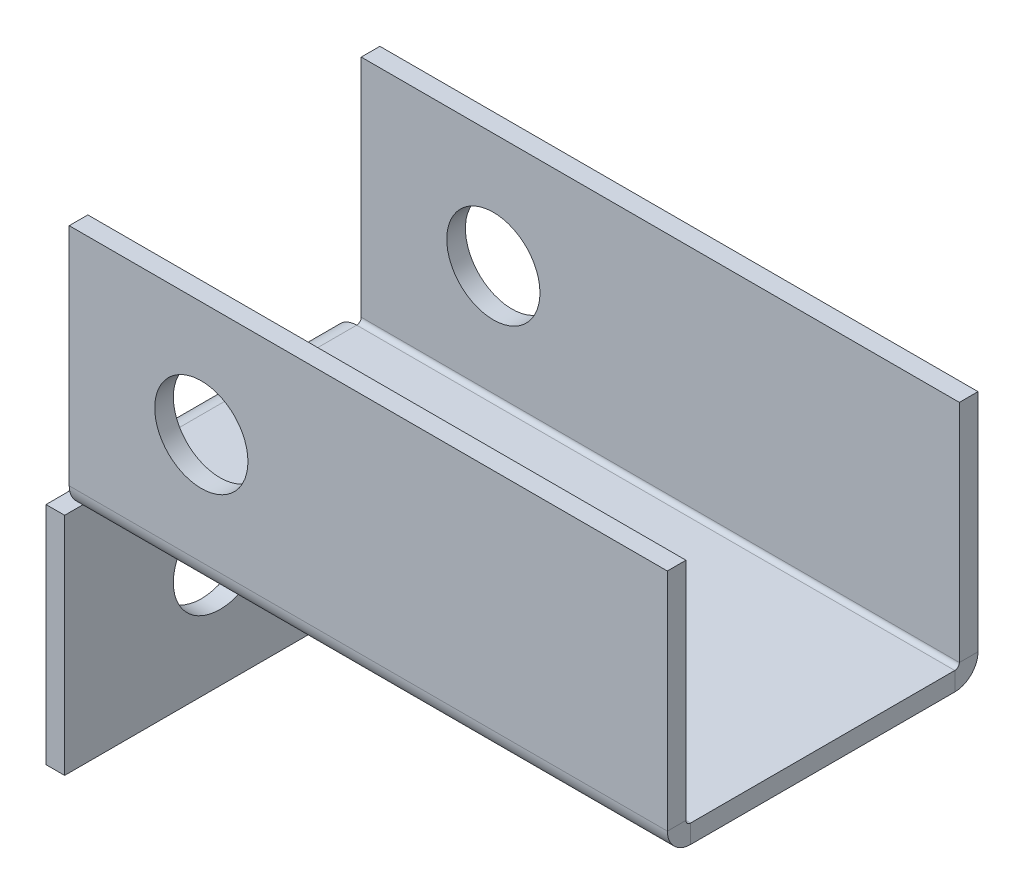
ISO-10303-21;
HEADER;
FILE_DESCRIPTION(('STEP AP214'),'2;1');
FILE_NAME('part.step','',(''),(''),'','','');
FILE_SCHEMA(('AUTOMOTIVE_DESIGN { 1 0 10303 214 1 1 1 1 }'));
ENDSEC;
DATA;
#1=APPLICATION_CONTEXT('core data for automotive mechanical design processes');
#2=APPLICATION_PROTOCOL_DEFINITION('international standard','automotive_design',2000,#1);
#3=PRODUCT_CONTEXT('',#1,'mechanical');
#4=PRODUCT('Part','Part','',(#3));
#5=PRODUCT_RELATED_PRODUCT_CATEGORY('part','',(#4));
#6=PRODUCT_DEFINITION_FORMATION('','',#4);
#7=PRODUCT_DEFINITION_CONTEXT('part definition',#1,'design');
#8=PRODUCT_DEFINITION('design','',#6,#7);
#9=PRODUCT_DEFINITION_SHAPE('','',#8);
#10=(LENGTH_UNIT() NAMED_UNIT(*) SI_UNIT(.MILLI.,.METRE.));
#11=(NAMED_UNIT(*) PLANE_ANGLE_UNIT() SI_UNIT($,.RADIAN.));
#12=(NAMED_UNIT(*) SI_UNIT($,.STERADIAN.) SOLID_ANGLE_UNIT());
#13=UNCERTAINTY_MEASURE_WITH_UNIT(LENGTH_MEASURE(1.E-05),#10,'distance_accuracy_value','');
#14=(GEOMETRIC_REPRESENTATION_CONTEXT(3) GLOBAL_UNCERTAINTY_ASSIGNED_CONTEXT((#13)) GLOBAL_UNIT_ASSIGNED_CONTEXT((#10,
#11,#12)) REPRESENTATION_CONTEXT('',''));
#15=CARTESIAN_POINT('',(0.,0.,0.));
#16=DIRECTION('',(0.,0.,1.));
#17=DIRECTION('',(1.,0.,0.));
#18=AXIS2_PLACEMENT_3D('',#15,#16,#17);
#19=CARTESIAN_POINT('',(0.,-3.73660000000017,0.));
#20=DIRECTION('',(0.,-1.,0.));
#21=DIRECTION('',(1.,0.,0.));
#22=AXIS2_PLACEMENT_3D('',#19,#20,#21);
#23=PLANE('',#22);
#24=DIRECTION('',(-1.,0.,0.));
#25=VECTOR('',#24,1.);
#26=CARTESIAN_POINT('',(-47.,-3.7366,-21.2634));
#27=LINE('',#26,#25);
#28=CARTESIAN_POINT('',(-47.,-3.7366,-21.2634));
#29=VERTEX_POINT('',#28);
#30=CARTESIAN_POINT('',(-50.,-3.73659999999999,-21.2634));
#31=VERTEX_POINT('',#30);
#32=EDGE_CURVE('E13',#29,#31,#27,.T.);
#33=ORIENTED_EDGE('',*,*,#32,.F.);
#34=DIRECTION('',(0.,0.,-1.));
#35=VECTOR('',#34,1.);
#36=CARTESIAN_POINT('',(-47.,-3.7366,25.));
#37=LINE('',#36,#35);
#38=CARTESIAN_POINT('',(-47.,-3.7366,-25.));
#39=VERTEX_POINT('',#38);
#40=EDGE_CURVE('E375',#29,#39,#37,.T.);
#41=ORIENTED_EDGE('',*,*,#40,.T.);
#42=DIRECTION('',(1.,0.,0.));
#43=VECTOR('',#42,1.);
#44=CARTESIAN_POINT('',(-47.,-3.7366,-25.));
#45=LINE('',#44,#43);
#46=CARTESIAN_POINT('',(-50.,-3.73659999999999,-25.));
#47=VERTEX_POINT('',#46);
#48=EDGE_CURVE('E369',#39,#47,#45,.F.);
#49=ORIENTED_EDGE('',*,*,#48,.T.);
#50=DIRECTION('',(0.,0.,-1.));
#51=VECTOR('',#50,1.);
#52=CARTESIAN_POINT('',(-50.,-3.73659999999999,25.));
#53=LINE('',#52,#51);
#54=EDGE_CURVE('E365',#47,#31,#53,.F.);
#55=ORIENTED_EDGE('',*,*,#54,.T.);
#56=EDGE_LOOP('',(#33,#41,#49,#55));
#57=FACE_BOUND('',#56,.T.);
#58=ADVANCED_FACE('F103',(#57),#23,.F.);
#59=CARTESIAN_POINT('',(-46.2634,-3.7366,-25.));
#60=DIRECTION('',(0.,0.,-1.));
#61=DIRECTION('',(-1.,0.,0.));
#62=AXIS2_PLACEMENT_3D('',#59,#60,#61);
#63=CYLINDRICAL_SURFACE('',#62,3.73659999999999);
#64=DIRECTION('',(0.,0.,-1.));
#65=VECTOR('',#64,1.);
#66=CARTESIAN_POINT('',(-46.2634,0.,-25.));
#67=LINE('',#66,#65);
#68=CARTESIAN_POINT('',(-46.2634,0.,-21.2634));
#69=VERTEX_POINT('',#68);
#70=CARTESIAN_POINT('',(-46.2634,0.,21.2634));
#71=VERTEX_POINT('',#70);
#72=EDGE_CURVE('E378',#69,#71,#67,.F.);
#73=ORIENTED_EDGE('',*,*,#72,.F.);
#74=CARTESIAN_POINT('',(-46.2634,-3.7366,-21.2634));
#75=DIRECTION('',(0.,0.,-1.));
#76=DIRECTION('',(0.,1.,0.));
#77=AXIS2_PLACEMENT_3D('',#74,#75,#76);
#78=CIRCLE('',#77,3.73659999999999);
#79=EDGE_CURVE('E111',#69,#31,#78,.F.);
#80=ORIENTED_EDGE('',*,*,#79,.T.);
#81=CARTESIAN_POINT('',(-50.,-3.73659999999999,21.2634));
#82=VERTEX_POINT('',#81);
#83=EDGE_CURVE('E367',#31,#82,#53,.F.);
#84=ORIENTED_EDGE('',*,*,#83,.T.);
#85=CARTESIAN_POINT('',(-46.2634,-3.7366,21.2634));
#86=DIRECTION('',(0.,0.,1.));
#87=DIRECTION('',(0.,-1.,0.));
#88=AXIS2_PLACEMENT_3D('',#85,#86,#87);
#89=CIRCLE('',#88,3.73659999999999);
#90=EDGE_CURVE('E387',#82,#71,#89,.F.);
#91=ORIENTED_EDGE('',*,*,#90,.T.);
#92=EDGE_LOOP('',(#73,#80,#84,#91));
#93=FACE_BOUND('',#92,.T.);
#94=ADVANCED_FACE('F402',(#93),#63,.T.);
#95=CARTESIAN_POINT('',(-46.2634,-3.7366,-21.2634));
#96=DIRECTION('',(0.,0.,-1.));
#97=DIRECTION('',(0.,1.,0.));
#98=AXIS2_PLACEMENT_3D('',#95,#96,#97);
#99=PLANE('',#98);
#100=CARTESIAN_POINT('',(-46.2634,-3.7366,-21.2634));
#101=DIRECTION('',(0.,0.,-1.));
#102=DIRECTION('',(0.,1.,0.));
#103=AXIS2_PLACEMENT_3D('',#100,#101,#102);
#104=CIRCLE('',#103,0.73659999999999);
#105=CARTESIAN_POINT('',(-46.2634,-3.00000000000002,-21.2634));
#106=VERTEX_POINT('',#105);
#107=EDGE_CURVE('E397',#106,#29,#104,.F.);
#108=ORIENTED_EDGE('',*,*,#107,.T.);
#109=ORIENTED_EDGE('',*,*,#32,.T.);
#110=ORIENTED_EDGE('',*,*,#79,.F.);
#111=DIRECTION('',(0.,-1.,0.));
#112=VECTOR('',#111,1.);
#113=CARTESIAN_POINT('',(-46.2634,0.,-21.2634));
#114=LINE('',#113,#112);
#115=EDGE_CURVE('E274',#69,#106,#114,.T.);
#116=ORIENTED_EDGE('',*,*,#115,.T.);
#117=EDGE_LOOP('',(#108,#109,#110,#116));
#118=FACE_BOUND('',#117,.T.);
#119=ADVANCED_FACE('F496',(#118),#99,.T.);
#120=CARTESIAN_POINT('',(0.,-3.,0.));
#121=DIRECTION('',(0.,-1.,0.));
#122=DIRECTION('',(0.,0.,-1.));
#123=AXIS2_PLACEMENT_3D('',#120,#121,#122);
#124=PLANE('',#123);
#125=DIRECTION('',(0.,0.,-1.));
#126=VECTOR('',#125,1.);
#127=CARTESIAN_POINT('',(-46.2634,-3.00000000000001,-25.));
#128=LINE('',#127,#126);
#129=CARTESIAN_POINT('',(-46.2634,-3.00000000000001,21.2634));
#130=VERTEX_POINT('',#129);
#131=EDGE_CURVE('E347',#106,#130,#128,.F.);
#132=ORIENTED_EDGE('',*,*,#131,.F.);
#133=DIRECTION('',(-1.,0.,0.));
#134=VECTOR('',#133,1.);
#135=CARTESIAN_POINT('',(-46.2634,-3.00000000000002,-21.2634));
#136=LINE('',#135,#134);
#137=CARTESIAN_POINT('',(50.,-3.,-21.2634));
#138=VERTEX_POINT('',#137);
#139=EDGE_CURVE('E267',#106,#138,#136,.F.);
#140=ORIENTED_EDGE('',*,*,#139,.T.);
#141=DIRECTION('',(0.,0.,-1.));
#142=VECTOR('',#141,1.);
#143=CARTESIAN_POINT('',(50.,-3.,-25.));
#144=LINE('',#143,#142);
#145=CARTESIAN_POINT('',(50.,-3.,21.2634));
#146=VERTEX_POINT('',#145);
#147=EDGE_CURVE('E384',#146,#138,#144,.T.);
#148=ORIENTED_EDGE('',*,*,#147,.F.);
#149=DIRECTION('',(1.,0.,0.));
#150=VECTOR('',#149,1.);
#151=CARTESIAN_POINT('',(50.,-3.,21.2634));
#152=LINE('',#151,#150);
#153=EDGE_CURVE('E321',#146,#130,#152,.F.);
#154=ORIENTED_EDGE('',*,*,#153,.T.);
#155=EDGE_LOOP('',(#132,#140,#148,#154));
#156=FACE_BOUND('',#155,.T.);
#157=ADVANCED_FACE('F443',(#156),#124,.T.);
#158=CARTESIAN_POINT('',(0.,0.,0.));
#159=DIRECTION('',(0.,-1.,0.));
#160=DIRECTION('',(0.,0.,-1.));
#161=AXIS2_PLACEMENT_3D('',#158,#159,#160);
#162=PLANE('',#161);
#163=DIRECTION('',(-1.,0.,0.));
#164=VECTOR('',#163,1.);
#165=CARTESIAN_POINT('',(-46.2634,0.,-21.2634));
#166=LINE('',#165,#164);
#167=CARTESIAN_POINT('',(50.,0.,-21.2634));
#168=VERTEX_POINT('',#167);
#169=EDGE_CURVE('E280',#69,#168,#166,.F.);
#170=ORIENTED_EDGE('',*,*,#169,.F.);
#171=ORIENTED_EDGE('',*,*,#72,.T.);
#172=DIRECTION('',(1.,0.,0.));
#173=VECTOR('',#172,1.);
#174=CARTESIAN_POINT('',(50.,0.,21.2634));
#175=LINE('',#174,#173);
#176=CARTESIAN_POINT('',(50.,0.,21.2634));
#177=VERTEX_POINT('',#176);
#178=EDGE_CURVE('E334',#177,#71,#175,.F.);
#179=ORIENTED_EDGE('',*,*,#178,.F.);
#180=DIRECTION('',(0.,0.,-1.));
#181=VECTOR('',#180,1.);
#182=CARTESIAN_POINT('',(50.,0.,-25.));
#183=LINE('',#182,#181);
#184=EDGE_CURVE('E381',#177,#168,#183,.T.);
#185=ORIENTED_EDGE('',*,*,#184,.T.);
#186=EDGE_LOOP('',(#170,#171,#179,#185));
#187=FACE_BOUND('',#186,.T.);
#188=ADVANCED_FACE('F457',(#187),#162,.F.);
#189=CARTESIAN_POINT('',(0.,-3.73660000000017,0.));
#190=DIRECTION('',(0.,1.,0.));
#191=DIRECTION('',(-1.,0.,0.));
#192=AXIS2_PLACEMENT_3D('',#189,#190,#191);
#193=PLANE('',#192);
#194=DIRECTION('',(1.,0.,0.));
#195=VECTOR('',#194,1.);
#196=CARTESIAN_POINT('',(-50.,-3.73659999999999,21.2634));
#197=LINE('',#196,#195);
#198=CARTESIAN_POINT('',(-47.,-3.7366,21.2634));
#199=VERTEX_POINT('',#198);
#200=EDGE_CURVE('E395',#82,#199,#197,.T.);
#201=ORIENTED_EDGE('',*,*,#200,.F.);
#202=CARTESIAN_POINT('',(-50.,-3.73659999999999,25.));
#203=VERTEX_POINT('',#202);
#204=EDGE_CURVE('E368',#82,#203,#53,.F.);
#205=ORIENTED_EDGE('',*,*,#204,.T.);
#206=DIRECTION('',(1.,0.,0.));
#207=VECTOR('',#206,1.);
#208=CARTESIAN_POINT('',(-50.,-3.73659999999999,25.));
#209=LINE('',#208,#207);
#210=CARTESIAN_POINT('',(-47.,-3.7366,25.));
#211=VERTEX_POINT('',#210);
#212=EDGE_CURVE('E341',#211,#203,#209,.F.);
#213=ORIENTED_EDGE('',*,*,#212,.F.);
#214=EDGE_CURVE('E371',#211,#199,#37,.T.);
#215=ORIENTED_EDGE('',*,*,#214,.T.);
#216=EDGE_LOOP('',(#201,#205,#213,#215));
#217=FACE_BOUND('',#216,.T.);
#218=ADVANCED_FACE('F431',(#217),#193,.T.);
#219=CARTESIAN_POINT('',(50.,-3.,-25.));
#220=DIRECTION('',(1.,0.,0.));
#221=DIRECTION('',(0.,0.,-1.));
#222=AXIS2_PLACEMENT_3D('',#219,#220,#221);
#223=PLANE('',#222);
#224=DIRECTION('',(0.,-1.,0.));
#225=VECTOR('',#224,1.);
#226=CARTESIAN_POINT('',(50.,0.,-21.2634));
#227=LINE('',#226,#225);
#228=EDGE_CURVE('E285',#168,#138,#227,.T.);
#229=ORIENTED_EDGE('',*,*,#228,.F.);
#230=ORIENTED_EDGE('',*,*,#184,.F.);
#231=DIRECTION('',(0.,-1.,0.));
#232=VECTOR('',#231,1.);
#233=CARTESIAN_POINT('',(50.,0.,21.2634));
#234=LINE('',#233,#232);
#235=EDGE_CURVE('E328',#177,#146,#234,.T.);
#236=ORIENTED_EDGE('',*,*,#235,.T.);
#237=ORIENTED_EDGE('',*,*,#147,.T.);
#238=EDGE_LOOP('',(#229,#230,#236,#237));
#239=FACE_BOUND('',#238,.T.);
#240=ADVANCED_FACE('F454',(#239),#223,.T.);
#241=CARTESIAN_POINT('',(-46.2634,-3.7366,21.2634));
#242=DIRECTION('',(0.,0.,1.));
#243=DIRECTION('',(0.,-1.,0.));
#244=AXIS2_PLACEMENT_3D('',#241,#242,#243);
#245=PLANE('',#244);
#246=ORIENTED_EDGE('',*,*,#90,.F.);
#247=ORIENTED_EDGE('',*,*,#200,.T.);
#248=CARTESIAN_POINT('',(-46.2634,-3.7366,21.2634));
#249=DIRECTION('',(0.,0.,1.));
#250=DIRECTION('',(0.,-1.,0.));
#251=AXIS2_PLACEMENT_3D('',#248,#249,#250);
#252=CIRCLE('',#251,0.73659999999999);
#253=EDGE_CURVE('E392',#199,#130,#252,.F.);
#254=ORIENTED_EDGE('',*,*,#253,.T.);
#255=DIRECTION('',(0.,-1.,0.));
#256=VECTOR('',#255,1.);
#257=CARTESIAN_POINT('',(-46.2634,0.,21.2634));
#258=LINE('',#257,#256);
#259=EDGE_CURVE('E338',#71,#130,#258,.T.);
#260=ORIENTED_EDGE('',*,*,#259,.F.);
#261=EDGE_LOOP('',(#246,#247,#254,#260));
#262=FACE_BOUND('',#261,.T.);
#263=ADVANCED_FACE('F440',(#262),#245,.T.);
#264=CARTESIAN_POINT('',(-46.2634,-3.7366,-25.));
#265=DIRECTION('',(0.,0.,-1.));
#266=DIRECTION('',(-1.,0.,0.));
#267=AXIS2_PLACEMENT_3D('',#264,#265,#266);
#268=CYLINDRICAL_SURFACE('',#267,0.73659999999999);
#269=ORIENTED_EDGE('',*,*,#107,.F.);
#270=ORIENTED_EDGE('',*,*,#131,.T.);
#271=ORIENTED_EDGE('',*,*,#253,.F.);
#272=EDGE_CURVE('E374',#199,#29,#37,.T.);
#273=ORIENTED_EDGE('',*,*,#272,.T.);
#274=EDGE_LOOP('',(#269,#270,#271,#273));
#275=FACE_BOUND('',#274,.T.);
#276=ADVANCED_FACE('F435',(#275),#268,.F.);
#277=CARTESIAN_POINT('',(-50.0000000000001,-40.,-25.));
#278=DIRECTION('',(0.,0.,1.));
#279=DIRECTION('',(1.,0.,0.));
#280=AXIS2_PLACEMENT_3D('',#277,#278,#279);
#281=PLANE('',#280);
#282=ORIENTED_EDGE('',*,*,#48,.F.);
#283=DIRECTION('',(0.,1.,0.));
#284=VECTOR('',#283,1.);
#285=CARTESIAN_POINT('',(-47.0000000000001,-40.,-25.));
#286=LINE('',#285,#284);
#287=CARTESIAN_POINT('',(-47.0000000000001,-40.,-25.));
#288=VERTEX_POINT('',#287);
#289=EDGE_CURVE('E363',#39,#288,#286,.F.);
#290=ORIENTED_EDGE('',*,*,#289,.T.);
#291=DIRECTION('',(1.,0.,0.));
#292=VECTOR('',#291,1.);
#293=CARTESIAN_POINT('',(-50.0000000000001,-40.,-25.));
#294=LINE('',#293,#292);
#295=CARTESIAN_POINT('',(-50.0000000000001,-40.,-25.));
#296=VERTEX_POINT('',#295);
#297=EDGE_CURVE('E344',#296,#288,#294,.T.);
#298=ORIENTED_EDGE('',*,*,#297,.F.);
#299=DIRECTION('',(0.,-1.,0.));
#300=VECTOR('',#299,1.);
#301=CARTESIAN_POINT('',(-50.,1.90979454354656E-13,-25.));
#302=LINE('',#301,#300);
#303=EDGE_CURVE('E356',#47,#296,#302,.T.);
#304=ORIENTED_EDGE('',*,*,#303,.F.);
#305=EDGE_LOOP('',(#282,#290,#298,#304));
#306=FACE_BOUND('',#305,.T.);
#307=ADVANCED_FACE('F414',(#306),#281,.F.);
#308=CARTESIAN_POINT('',(-50.,-2.99999999999999,25.));
#309=DIRECTION('',(0.,0.,-1.));
#310=DIRECTION('',(-1.,0.,0.));
#311=AXIS2_PLACEMENT_3D('',#308,#309,#310);
#312=PLANE('',#311);
#313=ORIENTED_EDGE('',*,*,#212,.T.);
#314=DIRECTION('',(0.,1.,0.));
#315=VECTOR('',#314,1.);
#316=CARTESIAN_POINT('',(-50.,1.86291012527692E-13,25.));
#317=LINE('',#316,#315);
#318=CARTESIAN_POINT('',(-50.0000000000001,-40.,25.));
#319=VERTEX_POINT('',#318);
#320=EDGE_CURVE('E351',#319,#203,#317,.T.);
#321=ORIENTED_EDGE('',*,*,#320,.F.);
#322=DIRECTION('',(1.,0.,0.));
#323=VECTOR('',#322,1.);
#324=CARTESIAN_POINT('',(-50.0000000000001,-40.,25.));
#325=LINE('',#324,#323);
#326=CARTESIAN_POINT('',(-47.0000000000001,-40.,25.));
#327=VERTEX_POINT('',#326);
#328=EDGE_CURVE('E348',#319,#327,#325,.T.);
#329=ORIENTED_EDGE('',*,*,#328,.T.);
#330=DIRECTION('',(0.,-1.,0.));
#331=VECTOR('',#330,1.);
#332=CARTESIAN_POINT('',(-47.,-3.,25.));
#333=LINE('',#332,#331);
#334=EDGE_CURVE('E358',#327,#211,#333,.F.);
#335=ORIENTED_EDGE('',*,*,#334,.T.);
#336=EDGE_LOOP('',(#313,#321,#329,#335));
#337=FACE_BOUND('',#336,.T.);
#338=ADVANCED_FACE('F429',(#337),#312,.F.);
#339=CARTESIAN_POINT('',(-50.,1.88635233441174E-13,0.));
#340=DIRECTION('',(1.,0.,0.));
#341=DIRECTION('',(0.,1.,0.));
#342=AXIS2_PLACEMENT_3D('',#339,#340,#341);
#343=PLANE('',#342);
#344=CARTESIAN_POINT('',(-50.,-21.8683,0.));
#345=DIRECTION('',(-1.,0.,0.));
#346=DIRECTION('',(0.,-1.,0.));
#347=AXIS2_PLACEMENT_3D('',#344,#345,#346);
#348=CIRCLE('',#347,7.5);
#349=CARTESIAN_POINT('',(-50.0000000000001,-29.3683,0.));
#350=VERTEX_POINT('',#349);
#351=EDGE_CURVE('E859',#350,#350,#348,.T.);
#352=ORIENTED_EDGE('',*,*,#351,.F.);
#353=EDGE_LOOP('',(#352));
#354=FACE_BOUND('',#353,.T.);
#355=ORIENTED_EDGE('',*,*,#54,.F.);
#356=ORIENTED_EDGE('',*,*,#303,.T.);
#357=DIRECTION('',(0.,0.,1.));
#358=VECTOR('',#357,1.);
#359=CARTESIAN_POINT('',(-50.0000000000001,-40.,0.));
#360=LINE('',#359,#358);
#361=EDGE_CURVE('E354',#296,#319,#360,.T.);
#362=ORIENTED_EDGE('',*,*,#361,.T.);
#363=ORIENTED_EDGE('',*,*,#320,.T.);
#364=ORIENTED_EDGE('',*,*,#204,.F.);
#365=ORIENTED_EDGE('',*,*,#83,.F.);
#366=EDGE_LOOP('',(#355,#356,#362,#363,#364,#365));
#367=FACE_BOUND('',#366,.T.);
#368=ADVANCED_FACE('F408',(#354,#367),#343,.F.);
#369=CARTESIAN_POINT('',(-47.,1.78160789424645E-13,0.));
#370=DIRECTION('',(1.,0.,0.));
#371=DIRECTION('',(0.,1.,0.));
#372=AXIS2_PLACEMENT_3D('',#369,#370,#371);
#373=PLANE('',#372);
#374=CARTESIAN_POINT('',(-47.,-21.8683,0.));
#375=DIRECTION('',(1.,0.,0.));
#376=DIRECTION('',(0.,1.,0.));
#377=AXIS2_PLACEMENT_3D('',#374,#375,#376);
#378=CIRCLE('',#377,7.5);
#379=CARTESIAN_POINT('',(-47.,-14.3683,0.));
#380=VERTEX_POINT('',#379);
#381=EDGE_CURVE('E856',#380,#380,#378,.F.);
#382=ORIENTED_EDGE('',*,*,#381,.T.);
#383=EDGE_LOOP('',(#382));
#384=FACE_BOUND('',#383,.T.);
#385=ORIENTED_EDGE('',*,*,#289,.F.);
#386=ORIENTED_EDGE('',*,*,#40,.F.);
#387=ORIENTED_EDGE('',*,*,#272,.F.);
#388=ORIENTED_EDGE('',*,*,#214,.F.);
#389=ORIENTED_EDGE('',*,*,#334,.F.);
#390=DIRECTION('',(0.,0.,-1.));
#391=VECTOR('',#390,1.);
#392=CARTESIAN_POINT('',(-47.0000000000001,-40.,25.));
#393=LINE('',#392,#391);
#394=EDGE_CURVE('E361',#288,#327,#393,.F.);
#395=ORIENTED_EDGE('',*,*,#394,.F.);
#396=EDGE_LOOP('',(#385,#386,#387,#388,#389,#395));
#397=FACE_BOUND('',#396,.T.);
#398=ADVANCED_FACE('F418',(#384,#397),#373,.T.);
#399=CARTESIAN_POINT('',(-50.0000000000001,-40.,25.));
#400=DIRECTION('',(0.,1.,0.));
#401=DIRECTION('',(-1.,0.,0.));
#402=AXIS2_PLACEMENT_3D('',#399,#400,#401);
#403=PLANE('',#402);
#404=ORIENTED_EDGE('',*,*,#394,.T.);
#405=ORIENTED_EDGE('',*,*,#328,.F.);
#406=ORIENTED_EDGE('',*,*,#361,.F.);
#407=ORIENTED_EDGE('',*,*,#297,.T.);
#408=EDGE_LOOP('',(#404,#405,#406,#407));
#409=FACE_BOUND('',#408,.T.);
#410=ADVANCED_FACE('F426',(#409),#403,.F.);
#411=CARTESIAN_POINT('',(-46.2634,0.736599999999997,21.2634));
#412=DIRECTION('',(-1.,0.,0.));
#413=DIRECTION('',(0.,0.,1.));
#414=AXIS2_PLACEMENT_3D('',#411,#412,#413);
#415=PLANE('',#414);
#416=DIRECTION('',(0.,0.,-1.));
#417=VECTOR('',#416,1.);
#418=CARTESIAN_POINT('',(-46.2634,0.736599999999997,25.));
#419=LINE('',#418,#417);
#420=CARTESIAN_POINT('',(-46.2634,0.736599999999997,22.));
#421=VERTEX_POINT('',#420);
#422=CARTESIAN_POINT('',(-46.2634,0.736599999999997,25.));
#423=VERTEX_POINT('',#422);
#424=EDGE_CURVE('E288',#421,#423,#419,.F.);
#425=ORIENTED_EDGE('',*,*,#424,.F.);
#426=CARTESIAN_POINT('',(-46.2634,0.736599999999997,21.2634));
#427=DIRECTION('',(1.,0.,0.));
#428=DIRECTION('',(0.,0.,-1.));
#429=AXIS2_PLACEMENT_3D('',#426,#427,#428);
#430=CIRCLE('',#429,0.7366);
#431=EDGE_CURVE('E331',#71,#421,#430,.F.);
#432=ORIENTED_EDGE('',*,*,#431,.F.);
#433=ORIENTED_EDGE('',*,*,#259,.T.);
#434=CARTESIAN_POINT('',(-46.2634,0.736599999999997,21.2634));
#435=DIRECTION('',(1.,0.,0.));
#436=DIRECTION('',(0.,0.,-1.));
#437=AXIS2_PLACEMENT_3D('',#434,#435,#436);
#438=CIRCLE('',#437,3.7366);
#439=EDGE_CURVE('E324',#130,#423,#438,.F.);
#440=ORIENTED_EDGE('',*,*,#439,.T.);
#441=EDGE_LOOP('',(#425,#432,#433,#440));
#442=FACE_BOUND('',#441,.T.);
#443=ADVANCED_FACE('F463',(#442),#415,.T.);
#444=CARTESIAN_POINT('',(50.,0.736599999999997,21.2634));
#445=DIRECTION('',(-1.,0.,0.));
#446=DIRECTION('',(0.,0.,1.));
#447=AXIS2_PLACEMENT_3D('',#444,#445,#446);
#448=PLANE('',#447);
#449=CARTESIAN_POINT('',(50.,0.736599999999997,21.2634));
#450=DIRECTION('',(1.,0.,0.));
#451=DIRECTION('',(0.,0.,-1.));
#452=AXIS2_PLACEMENT_3D('',#449,#450,#451);
#453=CIRCLE('',#452,0.7366);
#454=CARTESIAN_POINT('',(50.,0.736599999999997,22.));
#455=VERTEX_POINT('',#454);
#456=EDGE_CURVE('E294',#455,#177,#453,.T.);
#457=ORIENTED_EDGE('',*,*,#456,.F.);
#458=DIRECTION('',(0.,0.,-1.));
#459=VECTOR('',#458,1.);
#460=CARTESIAN_POINT('',(50.,0.736599999999997,22.));
#461=LINE('',#460,#459);
#462=CARTESIAN_POINT('',(50.,0.736599999999997,25.));
#463=VERTEX_POINT('',#462);
#464=EDGE_CURVE('E314',#455,#463,#461,.F.);
#465=ORIENTED_EDGE('',*,*,#464,.T.);
#466=CARTESIAN_POINT('',(50.,0.736599999999997,21.2634));
#467=DIRECTION('',(1.,0.,0.));
#468=DIRECTION('',(0.,0.,-1.));
#469=AXIS2_PLACEMENT_3D('',#466,#467,#468);
#470=CIRCLE('',#469,3.7366);
#471=EDGE_CURVE('E325',#463,#146,#470,.T.);
#472=ORIENTED_EDGE('',*,*,#471,.T.);
#473=ORIENTED_EDGE('',*,*,#235,.F.);
#474=EDGE_LOOP('',(#457,#465,#472,#473));
#475=FACE_BOUND('',#474,.T.);
#476=ADVANCED_FACE('F448',(#475),#448,.F.);
#477=CARTESIAN_POINT('',(50.,0.736599999999997,21.2634));
#478=DIRECTION('',(1.,0.,0.));
#479=DIRECTION('',(0.,0.,1.));
#480=AXIS2_PLACEMENT_3D('',#477,#478,#479);
#481=CYLINDRICAL_SURFACE('',#480,3.7366);
#482=ORIENTED_EDGE('',*,*,#153,.F.);
#483=ORIENTED_EDGE('',*,*,#471,.F.);
#484=DIRECTION('',(1.,0.,0.));
#485=VECTOR('',#484,1.);
#486=CARTESIAN_POINT('',(-46.2634,0.736599999999997,25.));
#487=LINE('',#486,#485);
#488=EDGE_CURVE('E312',#463,#423,#487,.F.);
#489=ORIENTED_EDGE('',*,*,#488,.T.);
#490=ORIENTED_EDGE('',*,*,#439,.F.);
#491=EDGE_LOOP('',(#482,#483,#489,#490));
#492=FACE_BOUND('',#491,.T.);
#493=ADVANCED_FACE('F445',(#492),#481,.T.);
#494=CARTESIAN_POINT('',(50.,0.736599999999997,21.2634));
#495=DIRECTION('',(1.,0.,0.));
#496=DIRECTION('',(0.,0.,1.));
#497=AXIS2_PLACEMENT_3D('',#494,#495,#496);
#498=CYLINDRICAL_SURFACE('',#497,0.7366);
#499=ORIENTED_EDGE('',*,*,#178,.T.);
#500=ORIENTED_EDGE('',*,*,#431,.T.);
#501=DIRECTION('',(1.,0.,0.));
#502=VECTOR('',#501,1.);
#503=CARTESIAN_POINT('',(-46.2634,0.736599999999997,22.));
#504=LINE('',#503,#502);
#505=EDGE_CURVE('E317',#421,#455,#504,.T.);
#506=ORIENTED_EDGE('',*,*,#505,.T.);
#507=ORIENTED_EDGE('',*,*,#456,.T.);
#508=EDGE_LOOP('',(#499,#500,#506,#507));
#509=FACE_BOUND('',#508,.T.);
#510=ADVANCED_FACE('F460',(#509),#498,.F.);
#511=CARTESIAN_POINT('',(50.,37.,25.));
#512=DIRECTION('',(-1.,0.,0.));
#513=DIRECTION('',(0.,0.,1.));
#514=AXIS2_PLACEMENT_3D('',#511,#512,#513);
#515=PLANE('',#514);
#516=ORIENTED_EDGE('',*,*,#464,.F.);
#517=DIRECTION('',(0.,-1.,0.));
#518=VECTOR('',#517,1.);
#519=CARTESIAN_POINT('',(50.,37.,22.));
#520=LINE('',#519,#518);
#521=CARTESIAN_POINT('',(50.,37.,22.));
#522=VERTEX_POINT('',#521);
#523=EDGE_CURVE('E310',#455,#522,#520,.F.);
#524=ORIENTED_EDGE('',*,*,#523,.T.);
#525=DIRECTION('',(0.,0.,-1.));
#526=VECTOR('',#525,1.);
#527=CARTESIAN_POINT('',(50.,37.,25.));
#528=LINE('',#527,#526);
#529=CARTESIAN_POINT('',(50.,37.,25.));
#530=VERTEX_POINT('',#529);
#531=EDGE_CURVE('E291',#530,#522,#528,.T.);
#532=ORIENTED_EDGE('',*,*,#531,.F.);
#533=DIRECTION('',(0.,1.,0.));
#534=VECTOR('',#533,1.);
#535=CARTESIAN_POINT('',(50.,0.,25.));
#536=LINE('',#535,#534);
#537=EDGE_CURVE('E303',#463,#530,#536,.T.);
#538=ORIENTED_EDGE('',*,*,#537,.F.);
#539=EDGE_LOOP('',(#516,#524,#532,#538));
#540=FACE_BOUND('',#539,.T.);
#541=ADVANCED_FACE('F481',(#540),#515,.F.);
#542=CARTESIAN_POINT('',(-46.2634,0.,25.));
#543=DIRECTION('',(1.,0.,0.));
#544=DIRECTION('',(0.,0.,-1.));
#545=AXIS2_PLACEMENT_3D('',#542,#543,#544);
#546=PLANE('',#545);
#547=ORIENTED_EDGE('',*,*,#424,.T.);
#548=DIRECTION('',(0.,-1.,0.));
#549=VECTOR('',#548,1.);
#550=CARTESIAN_POINT('',(-46.2634,0.,25.));
#551=LINE('',#550,#549);
#552=CARTESIAN_POINT('',(-46.2634,37.,25.));
#553=VERTEX_POINT('',#552);
#554=EDGE_CURVE('E298',#553,#423,#551,.T.);
#555=ORIENTED_EDGE('',*,*,#554,.F.);
#556=DIRECTION('',(0.,0.,-1.));
#557=VECTOR('',#556,1.);
#558=CARTESIAN_POINT('',(-46.2634,37.,25.));
#559=LINE('',#558,#557);
#560=CARTESIAN_POINT('',(-46.2634,37.,22.));
#561=VERTEX_POINT('',#560);
#562=EDGE_CURVE('E295',#553,#561,#559,.T.);
#563=ORIENTED_EDGE('',*,*,#562,.T.);
#564=DIRECTION('',(0.,1.,0.));
#565=VECTOR('',#564,1.);
#566=CARTESIAN_POINT('',(-46.2634,0.,22.));
#567=LINE('',#566,#565);
#568=EDGE_CURVE('E305',#561,#421,#567,.F.);
#569=ORIENTED_EDGE('',*,*,#568,.T.);
#570=EDGE_LOOP('',(#547,#555,#563,#569));
#571=FACE_BOUND('',#570,.T.);
#572=ADVANCED_FACE('F466',(#571),#546,.F.);
#573=CARTESIAN_POINT('',(0.,0.,25.));
#574=DIRECTION('',(0.,0.,-1.));
#575=DIRECTION('',(-1.,0.,0.));
#576=AXIS2_PLACEMENT_3D('',#573,#574,#575);
#577=PLANE('',#576);
#578=CARTESIAN_POINT('',(-25.,18.5,25.));
#579=DIRECTION('',(0.,0.,1.));
#580=DIRECTION('',(1.,0.,0.));
#581=AXIS2_PLACEMENT_3D('',#578,#579,#580);
#582=CIRCLE('',#581,7.5);
#583=CARTESIAN_POINT('',(-17.5,18.5,25.));
#584=VERTEX_POINT('',#583);
#585=EDGE_CURVE('E860',#584,#584,#582,.T.);
#586=ORIENTED_EDGE('',*,*,#585,.F.);
#587=EDGE_LOOP('',(#586));
#588=FACE_BOUND('',#587,.T.);
#589=ORIENTED_EDGE('',*,*,#488,.F.);
#590=ORIENTED_EDGE('',*,*,#537,.T.);
#591=DIRECTION('',(-1.,0.,0.));
#592=VECTOR('',#591,1.);
#593=CARTESIAN_POINT('',(0.,37.,25.));
#594=LINE('',#593,#592);
#595=EDGE_CURVE('E301',#530,#553,#594,.T.);
#596=ORIENTED_EDGE('',*,*,#595,.T.);
#597=ORIENTED_EDGE('',*,*,#554,.T.);
#598=EDGE_LOOP('',(#589,#590,#596,#597));
#599=FACE_BOUND('',#598,.T.);
#600=ADVANCED_FACE('F469',(#588,#599),#577,.F.);
#601=CARTESIAN_POINT('',(0.,0.,22.));
#602=DIRECTION('',(0.,0.,-1.));
#603=DIRECTION('',(-1.,0.,0.));
#604=AXIS2_PLACEMENT_3D('',#601,#602,#603);
#605=PLANE('',#604);
#606=CARTESIAN_POINT('',(-25.,18.5,22.));
#607=DIRECTION('',(0.,0.,-1.));
#608=DIRECTION('',(-1.,0.,0.));
#609=AXIS2_PLACEMENT_3D('',#606,#607,#608);
#610=CIRCLE('',#609,7.5);
#611=CARTESIAN_POINT('',(-32.5,18.5,22.));
#612=VERTEX_POINT('',#611);
#613=EDGE_CURVE('E266',#612,#612,#610,.T.);
#614=ORIENTED_EDGE('',*,*,#613,.F.);
#615=EDGE_LOOP('',(#614));
#616=FACE_BOUND('',#615,.T.);
#617=ORIENTED_EDGE('',*,*,#523,.F.);
#618=ORIENTED_EDGE('',*,*,#505,.F.);
#619=ORIENTED_EDGE('',*,*,#568,.F.);
#620=DIRECTION('',(1.,0.,0.));
#621=VECTOR('',#620,1.);
#622=CARTESIAN_POINT('',(-46.2634,37.,22.));
#623=LINE('',#622,#621);
#624=EDGE_CURVE('E308',#522,#561,#623,.F.);
#625=ORIENTED_EDGE('',*,*,#624,.F.);
#626=EDGE_LOOP('',(#617,#618,#619,#625));
#627=FACE_BOUND('',#626,.T.);
#628=ADVANCED_FACE('F479',(#616,#627),#605,.T.);
#629=CARTESIAN_POINT('',(-46.2634,37.,25.));
#630=DIRECTION('',(0.,-1.,0.));
#631=DIRECTION('',(0.,0.,-1.));
#632=AXIS2_PLACEMENT_3D('',#629,#630,#631);
#633=PLANE('',#632);
#634=ORIENTED_EDGE('',*,*,#624,.T.);
#635=ORIENTED_EDGE('',*,*,#562,.F.);
#636=ORIENTED_EDGE('',*,*,#595,.F.);
#637=ORIENTED_EDGE('',*,*,#531,.T.);
#638=EDGE_LOOP('',(#634,#635,#636,#637));
#639=FACE_BOUND('',#638,.T.);
#640=ADVANCED_FACE('F475',(#639),#633,.F.);
#641=CARTESIAN_POINT('',(50.,0.736599999999994,-21.2634));
#642=DIRECTION('',(1.,0.,0.));
#643=DIRECTION('',(0.,1.,0.));
#644=AXIS2_PLACEMENT_3D('',#641,#642,#643);
#645=PLANE('',#644);
#646=DIRECTION('',(0.,0.,1.));
#647=VECTOR('',#646,1.);
#648=CARTESIAN_POINT('',(50.,0.736600000000018,-25.));
#649=LINE('',#648,#647);
#650=CARTESIAN_POINT('',(50.,0.736599999999991,-22.));
#651=VERTEX_POINT('',#650);
#652=CARTESIAN_POINT('',(50.,0.73659999999998,-25.));
#653=VERTEX_POINT('',#652);
#654=EDGE_CURVE('E249',#651,#653,#649,.F.);
#655=ORIENTED_EDGE('',*,*,#654,.F.);
#656=CARTESIAN_POINT('',(50.,0.736599999999994,-21.2634));
#657=DIRECTION('',(-1.,0.,0.));
#658=DIRECTION('',(0.,-1.,0.));
#659=AXIS2_PLACEMENT_3D('',#656,#657,#658);
#660=CIRCLE('',#659,0.736600000000004);
#661=EDGE_CURVE('E277',#168,#651,#660,.F.);
#662=ORIENTED_EDGE('',*,*,#661,.F.);
#663=ORIENTED_EDGE('',*,*,#228,.T.);
#664=CARTESIAN_POINT('',(50.,0.736599999999994,-21.2634));
#665=DIRECTION('',(-1.,0.,0.));
#666=DIRECTION('',(0.,-1.,0.));
#667=AXIS2_PLACEMENT_3D('',#664,#665,#666);
#668=CIRCLE('',#667,3.7366);
#669=EDGE_CURVE('E270',#138,#653,#668,.F.);
#670=ORIENTED_EDGE('',*,*,#669,.T.);
#671=EDGE_LOOP('',(#655,#662,#663,#670));
#672=FACE_BOUND('',#671,.T.);
#673=ADVANCED_FACE('F608',(#672),#645,.T.);
#674=CARTESIAN_POINT('',(-46.2634,0.736599999999987,-21.2634));
#675=DIRECTION('',(1.,0.,0.));
#676=DIRECTION('',(0.,1.,0.));
#677=AXIS2_PLACEMENT_3D('',#674,#675,#676);
#678=PLANE('',#677);
#679=CARTESIAN_POINT('',(-46.2634,0.736599999999987,-21.2634));
#680=DIRECTION('',(-1.,0.,0.));
#681=DIRECTION('',(0.,-1.,0.));
#682=AXIS2_PLACEMENT_3D('',#679,#680,#681);
#683=CIRCLE('',#682,0.736600000000004);
#684=CARTESIAN_POINT('',(-46.2634,0.736599999999984,-22.));
#685=VERTEX_POINT('',#684);
#686=EDGE_CURVE('E282',#685,#69,#683,.T.);
#687=ORIENTED_EDGE('',*,*,#686,.F.);
#688=DIRECTION('',(0.,0.,1.));
#689=VECTOR('',#688,1.);
#690=CARTESIAN_POINT('',(-46.2634,0.736599999999993,-22.));
#691=LINE('',#690,#689);
#692=CARTESIAN_POINT('',(-46.2634,0.736600000000014,-25.));
#693=VERTEX_POINT('',#692);
#694=EDGE_CURVE('E260',#685,#693,#691,.F.);
#695=ORIENTED_EDGE('',*,*,#694,.T.);
#696=CARTESIAN_POINT('',(-46.2634,0.736599999999987,-21.2634));
#697=DIRECTION('',(-1.,0.,0.));
#698=DIRECTION('',(0.,-1.,0.));
#699=AXIS2_PLACEMENT_3D('',#696,#697,#698);
#700=CIRCLE('',#699,3.7366);
#701=EDGE_CURVE('E271',#693,#106,#700,.T.);
#702=ORIENTED_EDGE('',*,*,#701,.T.);
#703=ORIENTED_EDGE('',*,*,#115,.F.);
#704=EDGE_LOOP('',(#687,#695,#702,#703));
#705=FACE_BOUND('',#704,.T.);
#706=ADVANCED_FACE('F619',(#705),#678,.F.);
#707=CARTESIAN_POINT('',(-46.2634,0.736599999999987,-21.2634));
#708=DIRECTION('',(-1.,0.,0.));
#709=DIRECTION('',(0.,0.,-1.));
#710=AXIS2_PLACEMENT_3D('',#707,#708,#709);
#711=CYLINDRICAL_SURFACE('',#710,3.7366);
#712=ORIENTED_EDGE('',*,*,#139,.F.);
#713=ORIENTED_EDGE('',*,*,#701,.F.);
#714=DIRECTION('',(-1.,0.,0.));
#715=VECTOR('',#714,1.);
#716=CARTESIAN_POINT('',(50.,0.736600000000018,-25.));
#717=LINE('',#716,#715);
#718=EDGE_CURVE('E258',#693,#653,#717,.F.);
#719=ORIENTED_EDGE('',*,*,#718,.T.);
#720=ORIENTED_EDGE('',*,*,#669,.F.);
#721=EDGE_LOOP('',(#712,#713,#719,#720));
#722=FACE_BOUND('',#721,.T.);
#723=ADVANCED_FACE('F630',(#722),#711,.T.);
#724=CARTESIAN_POINT('',(-46.2634,0.736599999999987,-21.2634));
#725=DIRECTION('',(-1.,0.,0.));
#726=DIRECTION('',(0.,0.,-1.));
#727=AXIS2_PLACEMENT_3D('',#724,#725,#726);
#728=CYLINDRICAL_SURFACE('',#727,0.736600000000004);
#729=ORIENTED_EDGE('',*,*,#169,.T.);
#730=ORIENTED_EDGE('',*,*,#661,.T.);
#731=DIRECTION('',(-1.,0.,0.));
#732=VECTOR('',#731,1.);
#733=CARTESIAN_POINT('',(50.,0.736599999999997,-22.));
#734=LINE('',#733,#732);
#735=EDGE_CURVE('E263',#651,#685,#734,.T.);
#736=ORIENTED_EDGE('',*,*,#735,.T.);
#737=ORIENTED_EDGE('',*,*,#686,.T.);
#738=EDGE_LOOP('',(#729,#730,#736,#737));
#739=FACE_BOUND('',#738,.T.);
#740=ADVANCED_FACE('F641',(#739),#728,.F.);
#741=CARTESIAN_POINT('',(50.,0.,-25.));
#742=DIRECTION('',(-1.,0.,0.));
#743=DIRECTION('',(0.,-1.,0.));
#744=AXIS2_PLACEMENT_3D('',#741,#742,#743);
#745=PLANE('',#744);
#746=ORIENTED_EDGE('',*,*,#654,.T.);
#747=DIRECTION('',(0.,-1.,0.));
#748=VECTOR('',#747,1.);
#749=CARTESIAN_POINT('',(50.,0.,-25.));
#750=LINE('',#749,#748);
#751=CARTESIAN_POINT('',(50.,37.,-25.0000000000001));
#752=VERTEX_POINT('',#751);
#753=EDGE_CURVE('E230',#752,#653,#750,.T.);
#754=ORIENTED_EDGE('',*,*,#753,.F.);
#755=DIRECTION('',(0.,0.,1.));
#756=VECTOR('',#755,1.);
#757=CARTESIAN_POINT('',(50.,37.,-25.0000000000001));
#758=LINE('',#757,#756);
#759=CARTESIAN_POINT('',(50.,37.,-22.0000000000001));
#760=VERTEX_POINT('',#759);
#761=EDGE_CURVE('E236',#752,#760,#758,.T.);
#762=ORIENTED_EDGE('',*,*,#761,.T.);
#763=DIRECTION('',(0.,1.,0.));
#764=VECTOR('',#763,1.);
#765=CARTESIAN_POINT('',(50.,0.,-22.));
#766=LINE('',#765,#764);
#767=EDGE_CURVE('E256',#760,#651,#766,.F.);
#768=ORIENTED_EDGE('',*,*,#767,.T.);
#769=EDGE_LOOP('',(#746,#754,#762,#768));
#770=FACE_BOUND('',#769,.T.);
#771=ADVANCED_FACE('F248',(#770),#745,.F.);
#772=CARTESIAN_POINT('',(-46.2634,37.,-25.0000000000001));
#773=DIRECTION('',(1.,0.,0.));
#774=DIRECTION('',(0.,1.,0.));
#775=AXIS2_PLACEMENT_3D('',#772,#773,#774);
#776=PLANE('',#775);
#777=ORIENTED_EDGE('',*,*,#694,.F.);
#778=DIRECTION('',(0.,-1.,0.));
#779=VECTOR('',#778,1.);
#780=CARTESIAN_POINT('',(-46.2634,37.,-22.0000000000001));
#781=LINE('',#780,#779);
#782=CARTESIAN_POINT('',(-46.2634,37.,-22.0000000000001));
#783=VERTEX_POINT('',#782);
#784=EDGE_CURVE('E252',#685,#783,#781,.F.);
#785=ORIENTED_EDGE('',*,*,#784,.T.);
#786=DIRECTION('',(0.,0.,1.));
#787=VECTOR('',#786,1.);
#788=CARTESIAN_POINT('',(-46.2634,37.,-25.0000000000001));
#789=LINE('',#788,#787);
#790=CARTESIAN_POINT('',(-46.2634,37.,-25.0000000000001));
#791=VERTEX_POINT('',#790);
#792=EDGE_CURVE('E245',#791,#783,#789,.T.);
#793=ORIENTED_EDGE('',*,*,#792,.F.);
#794=DIRECTION('',(0.,1.,0.));
#795=VECTOR('',#794,1.);
#796=CARTESIAN_POINT('',(-46.2634,-1.05886748200073E-13,-25.));
#797=LINE('',#796,#795);
#798=EDGE_CURVE('E232',#693,#791,#797,.T.);
#799=ORIENTED_EDGE('',*,*,#798,.F.);
#800=EDGE_LOOP('',(#777,#785,#793,#799));
#801=FACE_BOUND('',#800,.T.);
#802=ADVANCED_FACE('F662',(#801),#776,.F.);
#803=CARTESIAN_POINT('',(0.,0.,-25.));
#804=DIRECTION('',(0.,0.,1.));
#805=DIRECTION('',(0.,-1.,0.));
#806=AXIS2_PLACEMENT_3D('',#803,#804,#805);
#807=PLANE('',#806);
#808=CARTESIAN_POINT('',(-25.,18.5,-25.0000000000001));
#809=DIRECTION('',(0.,0.,1.));
#810=DIRECTION('',(1.,0.,0.));
#811=AXIS2_PLACEMENT_3D('',#808,#809,#810);
#812=CIRCLE('',#811,7.5);
#813=CARTESIAN_POINT('',(-17.5,18.5,-25.0000000000001));
#814=VERTEX_POINT('',#813);
#815=EDGE_CURVE('E863',#814,#814,#812,.T.);
#816=ORIENTED_EDGE('',*,*,#815,.T.);
#817=EDGE_LOOP('',(#816));
#818=FACE_BOUND('',#817,.T.);
#819=ORIENTED_EDGE('',*,*,#718,.F.);
#820=ORIENTED_EDGE('',*,*,#798,.T.);
#821=DIRECTION('',(1.,0.,0.));
#822=VECTOR('',#821,1.);
#823=CARTESIAN_POINT('',(0.,37.,-25.0000000000001));
#824=LINE('',#823,#822);
#825=EDGE_CURVE('E225',#791,#752,#824,.T.);
#826=ORIENTED_EDGE('',*,*,#825,.T.);
#827=ORIENTED_EDGE('',*,*,#753,.T.);
#828=EDGE_LOOP('',(#819,#820,#826,#827));
#829=FACE_BOUND('',#828,.T.);
#830=ADVANCED_FACE('F228',(#818,#829),#807,.F.);
#831=CARTESIAN_POINT('',(0.,0.,-22.));
#832=DIRECTION('',(0.,0.,1.));
#833=DIRECTION('',(0.,-1.,0.));
#834=AXIS2_PLACEMENT_3D('',#831,#832,#833);
#835=PLANE('',#834);
#836=CARTESIAN_POINT('',(-25.,18.5,-22.0000000000001));
#837=DIRECTION('',(0.,0.,1.));
#838=DIRECTION('',(0.,-1.,0.));
#839=AXIS2_PLACEMENT_3D('',#836,#837,#838);
#840=CIRCLE('',#839,7.5);
#841=CARTESIAN_POINT('',(-25.,11.,-22.));
#842=VERTEX_POINT('',#841);
#843=EDGE_CURVE('E106',#842,#842,#840,.T.);
#844=ORIENTED_EDGE('',*,*,#843,.F.);
#845=EDGE_LOOP('',(#844));
#846=FACE_BOUND('',#845,.T.);
#847=ORIENTED_EDGE('',*,*,#784,.F.);
#848=ORIENTED_EDGE('',*,*,#735,.F.);
#849=ORIENTED_EDGE('',*,*,#767,.F.);
#850=DIRECTION('',(-1.,0.,0.));
#851=VECTOR('',#850,1.);
#852=CARTESIAN_POINT('',(50.,37.,-22.0000000000001));
#853=LINE('',#852,#851);
#854=EDGE_CURVE('E241',#783,#760,#853,.F.);
#855=ORIENTED_EDGE('',*,*,#854,.F.);
#856=EDGE_LOOP('',(#847,#848,#849,#855));
#857=FACE_BOUND('',#856,.T.);
#858=ADVANCED_FACE('F685',(#846,#857),#835,.T.);
#859=CARTESIAN_POINT('',(50.,37.,-25.0000000000001));
#860=DIRECTION('',(0.,-1.,0.));
#861=DIRECTION('',(0.,0.,-1.));
#862=AXIS2_PLACEMENT_3D('',#859,#860,#861);
#863=PLANE('',#862);
#864=ORIENTED_EDGE('',*,*,#854,.T.);
#865=ORIENTED_EDGE('',*,*,#761,.F.);
#866=ORIENTED_EDGE('',*,*,#825,.F.);
#867=ORIENTED_EDGE('',*,*,#792,.T.);
#868=EDGE_LOOP('',(#864,#865,#866,#867));
#869=FACE_BOUND('',#868,.T.);
#870=ADVANCED_FACE('F239',(#869),#863,.F.);
#871=CARTESIAN_POINT('',(-25.,18.5,-25.0000000000001));
#872=DIRECTION('',(0.,0.,1.));
#873=DIRECTION('',(1.,0.,0.));
#874=AXIS2_PLACEMENT_3D('',#871,#872,#873);
#875=CYLINDRICAL_SURFACE('',#874,7.5);
#876=ORIENTED_EDGE('',*,*,#843,.T.);
#877=EDGE_LOOP('',(#876));
#878=FACE_BOUND('',#877,.T.);
#879=ORIENTED_EDGE('',*,*,#815,.F.);
#880=EDGE_LOOP('',(#879));
#881=FACE_BOUND('',#880,.T.);
#882=ADVANCED_FACE('F684',(#878,#881),#875,.F.);
#883=ORIENTED_EDGE('',*,*,#613,.T.);
#884=EDGE_LOOP('',(#883));
#885=FACE_BOUND('',#884,.T.);
#886=ORIENTED_EDGE('',*,*,#585,.T.);
#887=EDGE_LOOP('',(#886));
#888=FACE_BOUND('',#887,.T.);
#889=ADVANCED_FACE('F728',(#885,#888),#875,.F.);
#890=CARTESIAN_POINT('',(50.0010000000001,-21.8683000000004,0.));
#891=DIRECTION('',(-1.,0.,0.));
#892=DIRECTION('',(0.,-1.,0.));
#893=AXIS2_PLACEMENT_3D('',#890,#891,#892);
#894=CYLINDRICAL_SURFACE('',#893,7.5);
#895=ORIENTED_EDGE('',*,*,#381,.F.);
#896=EDGE_LOOP('',(#895));
#897=FACE_BOUND('',#896,.T.);
#898=ORIENTED_EDGE('',*,*,#351,.T.);
#899=EDGE_LOOP('',(#898));
#900=FACE_BOUND('',#899,.T.);
#901=ADVANCED_FACE('F738',(#897,#900),#894,.F.);
#902=CLOSED_SHELL('',(#58,#94,#119,#157,#188,#218,#240,#263,#276,#307,#338,#368,#398,#410,#443,
#476,#493,#510,#541,#572,#600,#628,#640,#673,#706,#723,#740,#771,#802,#830,#858,#870,#882,#889,#901));
#903=MANIFOLD_SOLID_BREP('B2',#902);
#904=ADVANCED_BREP_SHAPE_REPRESENTATION('',(#18,#903),#14);
#905=SHAPE_DEFINITION_REPRESENTATION(#9,#904);
ENDSEC;
END-ISO-10303-21;
